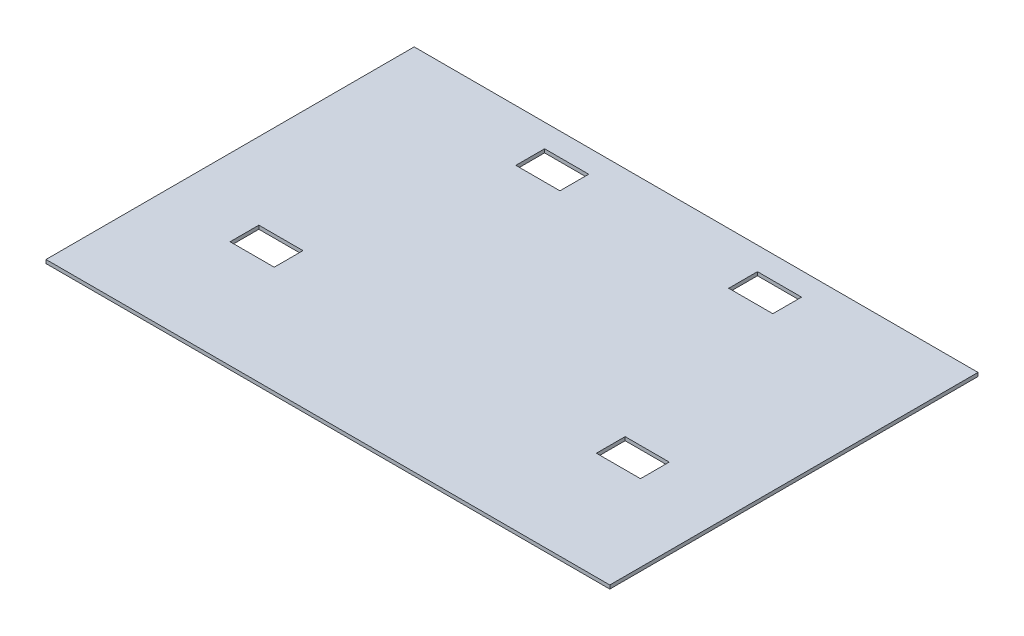
ISO-10303-21;
HEADER;
FILE_DESCRIPTION(('STEP AP214'),'2;1');
FILE_NAME('part.step','',(''),(''),'','','');
FILE_SCHEMA(('AUTOMOTIVE_DESIGN { 1 0 10303 214 1 1 1 1 }'));
ENDSEC;
DATA;
#1=APPLICATION_CONTEXT('core data for automotive mechanical design processes');
#2=APPLICATION_PROTOCOL_DEFINITION('international standard','automotive_design',2000,#1);
#3=PRODUCT_CONTEXT('',#1,'mechanical');
#4=PRODUCT('Part','Part','',(#3));
#5=PRODUCT_RELATED_PRODUCT_CATEGORY('part','',(#4));
#6=PRODUCT_DEFINITION_FORMATION('','',#4);
#7=PRODUCT_DEFINITION_CONTEXT('part definition',#1,'design');
#8=PRODUCT_DEFINITION('design','',#6,#7);
#9=PRODUCT_DEFINITION_SHAPE('','',#8);
#10=(LENGTH_UNIT() NAMED_UNIT(*) SI_UNIT(.MILLI.,.METRE.));
#11=(NAMED_UNIT(*) PLANE_ANGLE_UNIT() SI_UNIT($,.RADIAN.));
#12=(NAMED_UNIT(*) SI_UNIT($,.STERADIAN.) SOLID_ANGLE_UNIT());
#13=UNCERTAINTY_MEASURE_WITH_UNIT(LENGTH_MEASURE(1.E-05),#10,'distance_accuracy_value','');
#14=(GEOMETRIC_REPRESENTATION_CONTEXT(3) GLOBAL_UNCERTAINTY_ASSIGNED_CONTEXT((#13)) GLOBAL_UNIT_ASSIGNED_CONTEXT((#10,
#11,#12)) REPRESENTATION_CONTEXT('',''));
#15=CARTESIAN_POINT('',(0.,0.,0.));
#16=DIRECTION('',(0.,0.,1.));
#17=DIRECTION('',(1.,0.,0.));
#18=AXIS2_PLACEMENT_3D('',#15,#16,#17);
#19=CARTESIAN_POINT('',(933.45,5.953125,609.6));
#20=DIRECTION('',(-1.,0.,0.));
#21=DIRECTION('',(0.,0.,1.));
#22=AXIS2_PLACEMENT_3D('',#19,#20,#21);
#23=PLANE('',#22);
#24=DIRECTION('',(0.,0.,-1.));
#25=VECTOR('',#24,1.);
#26=CARTESIAN_POINT('',(933.45,-5.953125,609.6));
#27=LINE('',#26,#25);
#28=CARTESIAN_POINT('',(933.45,-5.953125,609.6));
#29=VERTEX_POINT('',#28);
#30=CARTESIAN_POINT('',(933.45,-5.953125,-609.6));
#31=VERTEX_POINT('',#30);
#32=EDGE_CURVE('E304',#29,#31,#27,.T.);
#33=ORIENTED_EDGE('',*,*,#32,.T.);
#34=DIRECTION('',(0.,-1.,0.));
#35=VECTOR('',#34,1.);
#36=CARTESIAN_POINT('',(933.45,5.953125,-609.6));
#37=LINE('',#36,#35);
#38=CARTESIAN_POINT('',(933.45,5.953125,-609.6));
#39=VERTEX_POINT('',#38);
#40=EDGE_CURVE('E11',#39,#31,#37,.T.);
#41=ORIENTED_EDGE('',*,*,#40,.F.);
#42=DIRECTION('',(0.,0.,-1.));
#43=VECTOR('',#42,1.);
#44=CARTESIAN_POINT('',(933.45,5.953125,609.6));
#45=LINE('',#44,#43);
#46=CARTESIAN_POINT('',(933.45,5.953125,609.6));
#47=VERTEX_POINT('',#46);
#48=EDGE_CURVE('E311',#47,#39,#45,.T.);
#49=ORIENTED_EDGE('',*,*,#48,.F.);
#50=DIRECTION('',(0.,-1.,0.));
#51=VECTOR('',#50,1.);
#52=CARTESIAN_POINT('',(933.45,5.953125,609.6));
#53=LINE('',#52,#51);
#54=EDGE_CURVE('E321',#47,#29,#53,.T.);
#55=ORIENTED_EDGE('',*,*,#54,.T.);
#56=EDGE_LOOP('',(#33,#41,#49,#55));
#57=FACE_BOUND('',#56,.T.);
#58=ADVANCED_FACE('F43',(#57),#23,.F.);
#59=CARTESIAN_POINT('',(-933.45,5.953125,-609.6));
#60=DIRECTION('',(0.,0.,1.));
#61=DIRECTION('',(1.,0.,0.));
#62=AXIS2_PLACEMENT_3D('',#59,#60,#61);
#63=PLANE('',#62);
#64=DIRECTION('',(-1.,0.,0.));
#65=VECTOR('',#64,1.);
#66=CARTESIAN_POINT('',(-933.45,-5.953125,-609.6));
#67=LINE('',#66,#65);
#68=CARTESIAN_POINT('',(-933.45,-5.953125,-609.6));
#69=VERTEX_POINT('',#68);
#70=EDGE_CURVE('E324',#31,#69,#67,.T.);
#71=ORIENTED_EDGE('',*,*,#70,.T.);
#72=DIRECTION('',(0.,-1.,0.));
#73=VECTOR('',#72,1.);
#74=CARTESIAN_POINT('',(-933.45,5.953125,-609.6));
#75=LINE('',#74,#73);
#76=CARTESIAN_POINT('',(-933.45,5.953125,-609.6));
#77=VERTEX_POINT('',#76);
#78=EDGE_CURVE('E50',#77,#69,#75,.T.);
#79=ORIENTED_EDGE('',*,*,#78,.F.);
#80=DIRECTION('',(-1.,0.,0.));
#81=VECTOR('',#80,1.);
#82=CARTESIAN_POINT('',(-933.45,5.953125,-609.6));
#83=LINE('',#82,#81);
#84=EDGE_CURVE('E314',#39,#77,#83,.T.);
#85=ORIENTED_EDGE('',*,*,#84,.F.);
#86=ORIENTED_EDGE('',*,*,#40,.T.);
#87=EDGE_LOOP('',(#71,#79,#85,#86));
#88=FACE_BOUND('',#87,.T.);
#89=ADVANCED_FACE('F353',(#88),#63,.F.);
#90=CARTESIAN_POINT('',(-933.45,5.953125,609.6));
#91=DIRECTION('',(1.,0.,0.));
#92=DIRECTION('',(0.,0.,-1.));
#93=AXIS2_PLACEMENT_3D('',#90,#91,#92);
#94=PLANE('',#93);
#95=DIRECTION('',(0.,0.,1.));
#96=VECTOR('',#95,1.);
#97=CARTESIAN_POINT('',(-933.45,-5.953125,609.6));
#98=LINE('',#97,#96);
#99=CARTESIAN_POINT('',(-933.45,-5.953125,609.6));
#100=VERTEX_POINT('',#99);
#101=EDGE_CURVE('E326',#69,#100,#98,.T.);
#102=ORIENTED_EDGE('',*,*,#101,.T.);
#103=DIRECTION('',(0.,-1.,0.));
#104=VECTOR('',#103,1.);
#105=CARTESIAN_POINT('',(-933.45,5.953125,609.6));
#106=LINE('',#105,#104);
#107=CARTESIAN_POINT('',(-933.45,5.953125,609.6));
#108=VERTEX_POINT('',#107);
#109=EDGE_CURVE('E331',#108,#100,#106,.T.);
#110=ORIENTED_EDGE('',*,*,#109,.F.);
#111=DIRECTION('',(0.,0.,1.));
#112=VECTOR('',#111,1.);
#113=CARTESIAN_POINT('',(-933.45,5.953125,609.6));
#114=LINE('',#113,#112);
#115=EDGE_CURVE('E317',#77,#108,#114,.T.);
#116=ORIENTED_EDGE('',*,*,#115,.F.);
#117=ORIENTED_EDGE('',*,*,#78,.T.);
#118=EDGE_LOOP('',(#102,#110,#116,#117));
#119=FACE_BOUND('',#118,.T.);
#120=ADVANCED_FACE('F338',(#119),#94,.F.);
#121=CARTESIAN_POINT('',(-933.45,5.953125,609.6));
#122=DIRECTION('',(0.,0.,-1.));
#123=DIRECTION('',(-1.,0.,0.));
#124=AXIS2_PLACEMENT_3D('',#121,#122,#123);
#125=PLANE('',#124);
#126=DIRECTION('',(1.,0.,0.));
#127=VECTOR('',#126,1.);
#128=CARTESIAN_POINT('',(-933.45,-5.953125,609.6));
#129=LINE('',#128,#127);
#130=EDGE_CURVE('E315',#100,#29,#129,.T.);
#131=ORIENTED_EDGE('',*,*,#130,.T.);
#132=ORIENTED_EDGE('',*,*,#54,.F.);
#133=DIRECTION('',(1.,0.,0.));
#134=VECTOR('',#133,1.);
#135=CARTESIAN_POINT('',(-933.45,5.953125,609.6));
#136=LINE('',#135,#134);
#137=EDGE_CURVE('E319',#108,#47,#136,.T.);
#138=ORIENTED_EDGE('',*,*,#137,.F.);
#139=ORIENTED_EDGE('',*,*,#109,.T.);
#140=EDGE_LOOP('',(#131,#132,#138,#139));
#141=FACE_BOUND('',#140,.T.);
#142=ADVANCED_FACE('F346',(#141),#125,.F.);
#143=CARTESIAN_POINT('',(0.,5.953125,0.));
#144=DIRECTION('',(0.,-1.,0.));
#145=DIRECTION('',(0.,0.,-1.));
#146=AXIS2_PLACEMENT_3D('',#143,#144,#145);
#147=PLANE('',#146);
#148=DIRECTION('',(-1.,0.,0.));
#149=VECTOR('',#148,1.);
#150=CARTESIAN_POINT('',(679.45,5.953125,254.));
#151=LINE('',#150,#149);
#152=CARTESIAN_POINT('',(679.45,5.953125,254.));
#153=VERTEX_POINT('',#152);
#154=CARTESIAN_POINT('',(533.4,5.953125,254.));
#155=VERTEX_POINT('',#154);
#156=EDGE_CURVE('E255',#153,#155,#151,.T.);
#157=ORIENTED_EDGE('',*,*,#156,.T.);
#158=DIRECTION('',(0.,0.,-1.));
#159=VECTOR('',#158,1.);
#160=CARTESIAN_POINT('',(533.4,5.953125,158.75));
#161=LINE('',#160,#159);
#162=CARTESIAN_POINT('',(533.4,5.953125,158.75));
#163=VERTEX_POINT('',#162);
#164=EDGE_CURVE('E266',#155,#163,#161,.T.);
#165=ORIENTED_EDGE('',*,*,#164,.T.);
#166=DIRECTION('',(1.,0.,0.));
#167=VECTOR('',#166,1.);
#168=CARTESIAN_POINT('',(679.45,5.953125,158.75));
#169=LINE('',#168,#167);
#170=CARTESIAN_POINT('',(679.45,5.953125,158.75));
#171=VERTEX_POINT('',#170);
#172=EDGE_CURVE('E276',#163,#171,#169,.T.);
#173=ORIENTED_EDGE('',*,*,#172,.T.);
#174=DIRECTION('',(0.,0.,1.));
#175=VECTOR('',#174,1.);
#176=CARTESIAN_POINT('',(679.45,5.953125,158.75));
#177=LINE('',#176,#175);
#178=EDGE_CURVE('E57',#171,#153,#177,.T.);
#179=ORIENTED_EDGE('',*,*,#178,.T.);
#180=EDGE_LOOP('',(#157,#165,#173,#179));
#181=FACE_BOUND('',#180,.T.);
#182=DIRECTION('',(-1.,0.,0.));
#183=VECTOR('',#182,1.);
#184=CARTESIAN_POINT('',(-533.4,5.953125,254.));
#185=LINE('',#184,#183);
#186=CARTESIAN_POINT('',(-533.4,5.953125,254.));
#187=VERTEX_POINT('',#186);
#188=CARTESIAN_POINT('',(-679.45,5.953125,254.));
#189=VERTEX_POINT('',#188);
#190=EDGE_CURVE('E225',#187,#189,#185,.T.);
#191=ORIENTED_EDGE('',*,*,#190,.T.);
#192=DIRECTION('',(0.,0.,-1.));
#193=VECTOR('',#192,1.);
#194=CARTESIAN_POINT('',(-679.45,5.953125,158.75));
#195=LINE('',#194,#193);
#196=CARTESIAN_POINT('',(-679.45,5.953125,158.75));
#197=VERTEX_POINT('',#196);
#198=EDGE_CURVE('E237',#189,#197,#195,.T.);
#199=ORIENTED_EDGE('',*,*,#198,.T.);
#200=DIRECTION('',(1.,0.,0.));
#201=VECTOR('',#200,1.);
#202=CARTESIAN_POINT('',(-533.4,5.953125,158.75));
#203=LINE('',#202,#201);
#204=CARTESIAN_POINT('',(-533.4,5.953125,158.75));
#205=VERTEX_POINT('',#204);
#206=EDGE_CURVE('E247',#197,#205,#203,.T.);
#207=ORIENTED_EDGE('',*,*,#206,.T.);
#208=DIRECTION('',(0.,0.,1.));
#209=VECTOR('',#208,1.);
#210=CARTESIAN_POINT('',(-533.4,5.953125,158.75));
#211=LINE('',#210,#209);
#212=EDGE_CURVE('E65',#205,#187,#211,.T.);
#213=ORIENTED_EDGE('',*,*,#212,.T.);
#214=EDGE_LOOP('',(#191,#199,#207,#213));
#215=FACE_BOUND('',#214,.T.);
#216=DIRECTION('',(-1.,0.,0.));
#217=VECTOR('',#216,1.);
#218=CARTESIAN_POINT('',(-279.4,5.953125,-438.15));
#219=LINE('',#218,#217);
#220=CARTESIAN_POINT('',(-279.4,5.953125,-438.15));
#221=VERTEX_POINT('',#220);
#222=CARTESIAN_POINT('',(-425.45,5.953125,-438.15));
#223=VERTEX_POINT('',#222);
#224=EDGE_CURVE('E212',#221,#223,#219,.T.);
#225=ORIENTED_EDGE('',*,*,#224,.T.);
#226=DIRECTION('',(0.,0.,-1.));
#227=VECTOR('',#226,1.);
#228=CARTESIAN_POINT('',(-425.45,5.953125,-533.4));
#229=LINE('',#228,#227);
#230=CARTESIAN_POINT('',(-425.45,5.953125,-533.4));
#231=VERTEX_POINT('',#230);
#232=EDGE_CURVE('E185',#223,#231,#229,.T.);
#233=ORIENTED_EDGE('',*,*,#232,.T.);
#234=DIRECTION('',(1.,0.,0.));
#235=VECTOR('',#234,1.);
#236=CARTESIAN_POINT('',(-279.4,5.953125,-533.4));
#237=LINE('',#236,#235);
#238=CARTESIAN_POINT('',(-279.4,5.953125,-533.4));
#239=VERTEX_POINT('',#238);
#240=EDGE_CURVE('E218',#231,#239,#237,.T.);
#241=ORIENTED_EDGE('',*,*,#240,.T.);
#242=DIRECTION('',(0.,0.,1.));
#243=VECTOR('',#242,1.);
#244=CARTESIAN_POINT('',(-279.4,5.953125,-533.4));
#245=LINE('',#244,#243);
#246=EDGE_CURVE('E214',#239,#221,#245,.T.);
#247=ORIENTED_EDGE('',*,*,#246,.T.);
#248=EDGE_LOOP('',(#225,#233,#241,#247));
#249=FACE_BOUND('',#248,.T.);
#250=DIRECTION('',(-1.,0.,0.));
#251=VECTOR('',#250,1.);
#252=CARTESIAN_POINT('',(425.45,5.953125,-438.15));
#253=LINE('',#252,#251);
#254=CARTESIAN_POINT('',(425.45,5.953125,-438.15));
#255=VERTEX_POINT('',#254);
#256=CARTESIAN_POINT('',(279.4,5.953125,-438.15));
#257=VERTEX_POINT('',#256);
#258=EDGE_CURVE('E291',#255,#257,#253,.T.);
#259=ORIENTED_EDGE('',*,*,#258,.T.);
#260=DIRECTION('',(0.,0.,-1.));
#261=VECTOR('',#260,1.);
#262=CARTESIAN_POINT('',(279.4,5.953125,-533.4));
#263=LINE('',#262,#261);
#264=CARTESIAN_POINT('',(279.4,5.953125,-533.4));
#265=VERTEX_POINT('',#264);
#266=EDGE_CURVE('E281',#257,#265,#263,.T.);
#267=ORIENTED_EDGE('',*,*,#266,.T.);
#268=DIRECTION('',(1.,0.,0.));
#269=VECTOR('',#268,1.);
#270=CARTESIAN_POINT('',(425.45,5.953125,-533.4));
#271=LINE('',#270,#269);
#272=CARTESIAN_POINT('',(425.45,5.953125,-533.4));
#273=VERTEX_POINT('',#272);
#274=EDGE_CURVE('E284',#265,#273,#271,.T.);
#275=ORIENTED_EDGE('',*,*,#274,.T.);
#276=DIRECTION('',(0.,0.,1.));
#277=VECTOR('',#276,1.);
#278=CARTESIAN_POINT('',(425.45,5.953125,-533.4));
#279=LINE('',#278,#277);
#280=EDGE_CURVE('E288',#273,#255,#279,.T.);
#281=ORIENTED_EDGE('',*,*,#280,.T.);
#282=EDGE_LOOP('',(#259,#267,#275,#281));
#283=FACE_BOUND('',#282,.T.);
#284=ORIENTED_EDGE('',*,*,#48,.T.);
#285=ORIENTED_EDGE('',*,*,#84,.T.);
#286=ORIENTED_EDGE('',*,*,#115,.T.);
#287=ORIENTED_EDGE('',*,*,#137,.T.);
#288=EDGE_LOOP('',(#284,#285,#286,#287));
#289=FACE_BOUND('',#288,.T.);
#290=ADVANCED_FACE('F352',(#181,#215,#249,#283,#289),#147,.F.);
#291=CARTESIAN_POINT('',(0.,-5.953125,0.));
#292=DIRECTION('',(0.,-1.,0.));
#293=DIRECTION('',(0.,0.,-1.));
#294=AXIS2_PLACEMENT_3D('',#291,#292,#293);
#295=PLANE('',#294);
#296=DIRECTION('',(0.,0.,-1.));
#297=VECTOR('',#296,1.);
#298=CARTESIAN_POINT('',(533.4,-5.953125,158.75));
#299=LINE('',#298,#297);
#300=CARTESIAN_POINT('',(533.4,-5.953125,254.));
#301=VERTEX_POINT('',#300);
#302=CARTESIAN_POINT('',(533.4,-5.953125,158.75));
#303=VERTEX_POINT('',#302);
#304=EDGE_CURVE('E232',#301,#303,#299,.T.);
#305=ORIENTED_EDGE('',*,*,#304,.F.);
#306=DIRECTION('',(-1.,0.,0.));
#307=VECTOR('',#306,1.);
#308=CARTESIAN_POINT('',(679.45,-5.953125,254.));
#309=LINE('',#308,#307);
#310=CARTESIAN_POINT('',(679.45,-5.953125,254.));
#311=VERTEX_POINT('',#310);
#312=EDGE_CURVE('E262',#311,#301,#309,.T.);
#313=ORIENTED_EDGE('',*,*,#312,.F.);
#314=DIRECTION('',(0.,0.,1.));
#315=VECTOR('',#314,1.);
#316=CARTESIAN_POINT('',(679.45,-5.953125,158.75));
#317=LINE('',#316,#315);
#318=CARTESIAN_POINT('',(679.45,-5.953125,158.75));
#319=VERTEX_POINT('',#318);
#320=EDGE_CURVE('E265',#319,#311,#317,.T.);
#321=ORIENTED_EDGE('',*,*,#320,.F.);
#322=DIRECTION('',(1.,0.,0.));
#323=VECTOR('',#322,1.);
#324=CARTESIAN_POINT('',(679.45,-5.953125,158.75));
#325=LINE('',#324,#323);
#326=EDGE_CURVE('E269',#303,#319,#325,.T.);
#327=ORIENTED_EDGE('',*,*,#326,.F.);
#328=EDGE_LOOP('',(#305,#313,#321,#327));
#329=FACE_BOUND('',#328,.T.);
#330=DIRECTION('',(0.,0.,-1.));
#331=VECTOR('',#330,1.);
#332=CARTESIAN_POINT('',(-679.45,-5.953125,158.75));
#333=LINE('',#332,#331);
#334=CARTESIAN_POINT('',(-679.45,-5.953125,254.));
#335=VERTEX_POINT('',#334);
#336=CARTESIAN_POINT('',(-679.45,-5.953125,158.75));
#337=VERTEX_POINT('',#336);
#338=EDGE_CURVE('E190',#335,#337,#333,.T.);
#339=ORIENTED_EDGE('',*,*,#338,.F.);
#340=DIRECTION('',(-1.,0.,0.));
#341=VECTOR('',#340,1.);
#342=CARTESIAN_POINT('',(-533.4,-5.953125,254.));
#343=LINE('',#342,#341);
#344=CARTESIAN_POINT('',(-533.4,-5.953125,254.));
#345=VERTEX_POINT('',#344);
#346=EDGE_CURVE('E233',#345,#335,#343,.T.);
#347=ORIENTED_EDGE('',*,*,#346,.F.);
#348=DIRECTION('',(0.,0.,1.));
#349=VECTOR('',#348,1.);
#350=CARTESIAN_POINT('',(-533.4,-5.953125,158.75));
#351=LINE('',#350,#349);
#352=CARTESIAN_POINT('',(-533.4,-5.953125,158.75));
#353=VERTEX_POINT('',#352);
#354=EDGE_CURVE('E236',#353,#345,#351,.T.);
#355=ORIENTED_EDGE('',*,*,#354,.F.);
#356=DIRECTION('',(1.,0.,0.));
#357=VECTOR('',#356,1.);
#358=CARTESIAN_POINT('',(-533.4,-5.953125,158.75));
#359=LINE('',#358,#357);
#360=EDGE_CURVE('E240',#337,#353,#359,.T.);
#361=ORIENTED_EDGE('',*,*,#360,.F.);
#362=EDGE_LOOP('',(#339,#347,#355,#361));
#363=FACE_BOUND('',#362,.T.);
#364=DIRECTION('',(0.,0.,-1.));
#365=VECTOR('',#364,1.);
#366=CARTESIAN_POINT('',(-425.45,-5.953125,-533.4));
#367=LINE('',#366,#365);
#368=CARTESIAN_POINT('',(-425.45,-5.953125,-438.15));
#369=VERTEX_POINT('',#368);
#370=CARTESIAN_POINT('',(-425.45,-5.953125,-533.4));
#371=VERTEX_POINT('',#370);
#372=EDGE_CURVE('E182',#369,#371,#367,.T.);
#373=ORIENTED_EDGE('',*,*,#372,.F.);
#374=DIRECTION('',(-1.,0.,0.));
#375=VECTOR('',#374,1.);
#376=CARTESIAN_POINT('',(-279.4,-5.953125,-438.15));
#377=LINE('',#376,#375);
#378=CARTESIAN_POINT('',(-279.4,-5.953125,-438.15));
#379=VERTEX_POINT('',#378);
#380=EDGE_CURVE('E193',#379,#369,#377,.T.);
#381=ORIENTED_EDGE('',*,*,#380,.F.);
#382=DIRECTION('',(0.,0.,1.));
#383=VECTOR('',#382,1.);
#384=CARTESIAN_POINT('',(-279.4,-5.953125,-533.4));
#385=LINE('',#384,#383);
#386=CARTESIAN_POINT('',(-279.4,-5.953125,-533.4));
#387=VERTEX_POINT('',#386);
#388=EDGE_CURVE('E198',#387,#379,#385,.T.);
#389=ORIENTED_EDGE('',*,*,#388,.F.);
#390=DIRECTION('',(1.,0.,0.));
#391=VECTOR('',#390,1.);
#392=CARTESIAN_POINT('',(-279.4,-5.953125,-533.4));
#393=LINE('',#392,#391);
#394=EDGE_CURVE('E204',#371,#387,#393,.T.);
#395=ORIENTED_EDGE('',*,*,#394,.F.);
#396=EDGE_LOOP('',(#373,#381,#389,#395));
#397=FACE_BOUND('',#396,.T.);
#398=DIRECTION('',(0.,0.,-1.));
#399=VECTOR('',#398,1.);
#400=CARTESIAN_POINT('',(279.4,-5.953125,-533.4));
#401=LINE('',#400,#399);
#402=CARTESIAN_POINT('',(279.4,-5.953125,-438.15));
#403=VERTEX_POINT('',#402);
#404=CARTESIAN_POINT('',(279.4,-5.953125,-533.4));
#405=VERTEX_POINT('',#404);
#406=EDGE_CURVE('E205',#403,#405,#401,.T.);
#407=ORIENTED_EDGE('',*,*,#406,.F.);
#408=DIRECTION('',(-1.,0.,0.));
#409=VECTOR('',#408,1.);
#410=CARTESIAN_POINT('',(425.45,-5.953125,-438.15));
#411=LINE('',#410,#409);
#412=CARTESIAN_POINT('',(425.45,-5.953125,-438.15));
#413=VERTEX_POINT('',#412);
#414=EDGE_CURVE('E285',#413,#403,#411,.T.);
#415=ORIENTED_EDGE('',*,*,#414,.F.);
#416=DIRECTION('',(0.,0.,1.));
#417=VECTOR('',#416,1.);
#418=CARTESIAN_POINT('',(425.45,-5.953125,-533.4));
#419=LINE('',#418,#417);
#420=CARTESIAN_POINT('',(425.45,-5.953125,-533.4));
#421=VERTEX_POINT('',#420);
#422=EDGE_CURVE('E297',#421,#413,#419,.T.);
#423=ORIENTED_EDGE('',*,*,#422,.F.);
#424=DIRECTION('',(1.,0.,0.));
#425=VECTOR('',#424,1.);
#426=CARTESIAN_POINT('',(425.45,-5.953125,-533.4));
#427=LINE('',#426,#425);
#428=EDGE_CURVE('E207',#405,#421,#427,.T.);
#429=ORIENTED_EDGE('',*,*,#428,.F.);
#430=EDGE_LOOP('',(#407,#415,#423,#429));
#431=FACE_BOUND('',#430,.T.);
#432=ORIENTED_EDGE('',*,*,#32,.F.);
#433=ORIENTED_EDGE('',*,*,#130,.F.);
#434=ORIENTED_EDGE('',*,*,#101,.F.);
#435=ORIENTED_EDGE('',*,*,#70,.F.);
#436=EDGE_LOOP('',(#432,#433,#434,#435));
#437=FACE_BOUND('',#436,.T.);
#438=ADVANCED_FACE('F201',(#329,#363,#397,#431,#437),#295,.T.);
#439=CARTESIAN_POINT('',(279.4,5.953125,-533.4));
#440=DIRECTION('',(-1.,0.,0.));
#441=DIRECTION('',(0.,0.,1.));
#442=AXIS2_PLACEMENT_3D('',#439,#440,#441);
#443=PLANE('',#442);
#444=ORIENTED_EDGE('',*,*,#406,.T.);
#445=DIRECTION('',(0.,-1.,0.));
#446=VECTOR('',#445,1.);
#447=CARTESIAN_POINT('',(279.4,5.953125,-533.4));
#448=LINE('',#447,#446);
#449=EDGE_CURVE('E293',#265,#405,#448,.T.);
#450=ORIENTED_EDGE('',*,*,#449,.F.);
#451=ORIENTED_EDGE('',*,*,#266,.F.);
#452=DIRECTION('',(0.,-1.,0.));
#453=VECTOR('',#452,1.);
#454=CARTESIAN_POINT('',(279.4,5.953125,-438.15));
#455=LINE('',#454,#453);
#456=EDGE_CURVE('E302',#257,#403,#455,.T.);
#457=ORIENTED_EDGE('',*,*,#456,.T.);
#458=EDGE_LOOP('',(#444,#450,#451,#457));
#459=FACE_BOUND('',#458,.T.);
#460=ADVANCED_FACE('F365',(#459),#443,.F.);
#461=CARTESIAN_POINT('',(425.45,5.953125,-438.15));
#462=DIRECTION('',(0.,0.,1.));
#463=DIRECTION('',(1.,0.,0.));
#464=AXIS2_PLACEMENT_3D('',#461,#462,#463);
#465=PLANE('',#464);
#466=ORIENTED_EDGE('',*,*,#414,.T.);
#467=ORIENTED_EDGE('',*,*,#456,.F.);
#468=ORIENTED_EDGE('',*,*,#258,.F.);
#469=DIRECTION('',(0.,-1.,0.));
#470=VECTOR('',#469,1.);
#471=CARTESIAN_POINT('',(425.45,5.953125,-438.15));
#472=LINE('',#471,#470);
#473=EDGE_CURVE('E305',#255,#413,#472,.T.);
#474=ORIENTED_EDGE('',*,*,#473,.T.);
#475=EDGE_LOOP('',(#466,#467,#468,#474));
#476=FACE_BOUND('',#475,.T.);
#477=ADVANCED_FACE('F372',(#476),#465,.F.);
#478=CARTESIAN_POINT('',(425.45,5.953125,-533.4));
#479=DIRECTION('',(1.,0.,0.));
#480=DIRECTION('',(0.,0.,-1.));
#481=AXIS2_PLACEMENT_3D('',#478,#479,#480);
#482=PLANE('',#481);
#483=ORIENTED_EDGE('',*,*,#422,.T.);
#484=ORIENTED_EDGE('',*,*,#473,.F.);
#485=ORIENTED_EDGE('',*,*,#280,.F.);
#486=DIRECTION('',(0.,-1.,0.));
#487=VECTOR('',#486,1.);
#488=CARTESIAN_POINT('',(425.45,5.953125,-533.4));
#489=LINE('',#488,#487);
#490=EDGE_CURVE('E307',#273,#421,#489,.T.);
#491=ORIENTED_EDGE('',*,*,#490,.T.);
#492=EDGE_LOOP('',(#483,#484,#485,#491));
#493=FACE_BOUND('',#492,.T.);
#494=ADVANCED_FACE('F377',(#493),#482,.F.);
#495=CARTESIAN_POINT('',(425.45,5.953125,-533.4));
#496=DIRECTION('',(0.,0.,-1.));
#497=DIRECTION('',(-1.,0.,0.));
#498=AXIS2_PLACEMENT_3D('',#495,#496,#497);
#499=PLANE('',#498);
#500=ORIENTED_EDGE('',*,*,#428,.T.);
#501=ORIENTED_EDGE('',*,*,#490,.F.);
#502=ORIENTED_EDGE('',*,*,#274,.F.);
#503=ORIENTED_EDGE('',*,*,#449,.T.);
#504=EDGE_LOOP('',(#500,#501,#502,#503));
#505=FACE_BOUND('',#504,.T.);
#506=ADVANCED_FACE('F374',(#505),#499,.F.);
#507=CARTESIAN_POINT('',(-425.45,5.953125,-533.4));
#508=DIRECTION('',(-1.,0.,0.));
#509=DIRECTION('',(0.,0.,1.));
#510=AXIS2_PLACEMENT_3D('',#507,#508,#509);
#511=PLANE('',#510);
#512=ORIENTED_EDGE('',*,*,#372,.T.);
#513=DIRECTION('',(0.,-1.,0.));
#514=VECTOR('',#513,1.);
#515=CARTESIAN_POINT('',(-425.45,5.953125,-533.4));
#516=LINE('',#515,#514);
#517=EDGE_CURVE('E215',#231,#371,#516,.T.);
#518=ORIENTED_EDGE('',*,*,#517,.F.);
#519=ORIENTED_EDGE('',*,*,#232,.F.);
#520=DIRECTION('',(0.,-1.,0.));
#521=VECTOR('',#520,1.);
#522=CARTESIAN_POINT('',(-425.45,5.953125,-438.15));
#523=LINE('',#522,#521);
#524=EDGE_CURVE('E178',#223,#369,#523,.T.);
#525=ORIENTED_EDGE('',*,*,#524,.T.);
#526=EDGE_LOOP('',(#512,#518,#519,#525));
#527=FACE_BOUND('',#526,.T.);
#528=ADVANCED_FACE('F180',(#527),#511,.F.);
#529=CARTESIAN_POINT('',(-279.4,5.953125,-438.15));
#530=DIRECTION('',(0.,0.,1.));
#531=DIRECTION('',(1.,0.,0.));
#532=AXIS2_PLACEMENT_3D('',#529,#530,#531);
#533=PLANE('',#532);
#534=ORIENTED_EDGE('',*,*,#380,.T.);
#535=ORIENTED_EDGE('',*,*,#524,.F.);
#536=ORIENTED_EDGE('',*,*,#224,.F.);
#537=DIRECTION('',(0.,-1.,0.));
#538=VECTOR('',#537,1.);
#539=CARTESIAN_POINT('',(-279.4,5.953125,-438.15));
#540=LINE('',#539,#538);
#541=EDGE_CURVE('E189',#221,#379,#540,.T.);
#542=ORIENTED_EDGE('',*,*,#541,.T.);
#543=EDGE_LOOP('',(#534,#535,#536,#542));
#544=FACE_BOUND('',#543,.T.);
#545=ADVANCED_FACE('F194',(#544),#533,.F.);
#546=CARTESIAN_POINT('',(-279.4,5.953125,-533.4));
#547=DIRECTION('',(1.,0.,0.));
#548=DIRECTION('',(0.,0.,-1.));
#549=AXIS2_PLACEMENT_3D('',#546,#547,#548);
#550=PLANE('',#549);
#551=ORIENTED_EDGE('',*,*,#388,.T.);
#552=ORIENTED_EDGE('',*,*,#541,.F.);
#553=ORIENTED_EDGE('',*,*,#246,.F.);
#554=DIRECTION('',(0.,-1.,0.));
#555=VECTOR('',#554,1.);
#556=CARTESIAN_POINT('',(-279.4,5.953125,-533.4));
#557=LINE('',#556,#555);
#558=EDGE_CURVE('E558',#239,#387,#557,.T.);
#559=ORIENTED_EDGE('',*,*,#558,.T.);
#560=EDGE_LOOP('',(#551,#552,#553,#559));
#561=FACE_BOUND('',#560,.T.);
#562=ADVANCED_FACE('F418',(#561),#550,.F.);
#563=CARTESIAN_POINT('',(-279.4,5.953125,-533.4));
#564=DIRECTION('',(0.,0.,-1.));
#565=DIRECTION('',(-1.,0.,0.));
#566=AXIS2_PLACEMENT_3D('',#563,#564,#565);
#567=PLANE('',#566);
#568=ORIENTED_EDGE('',*,*,#394,.T.);
#569=ORIENTED_EDGE('',*,*,#558,.F.);
#570=ORIENTED_EDGE('',*,*,#240,.F.);
#571=ORIENTED_EDGE('',*,*,#517,.T.);
#572=EDGE_LOOP('',(#568,#569,#570,#571));
#573=FACE_BOUND('',#572,.T.);
#574=ADVANCED_FACE('F414',(#573),#567,.F.);
#575=CARTESIAN_POINT('',(-679.45,5.953125,158.75));
#576=DIRECTION('',(-1.,0.,0.));
#577=DIRECTION('',(0.,0.,1.));
#578=AXIS2_PLACEMENT_3D('',#575,#576,#577);
#579=PLANE('',#578);
#580=ORIENTED_EDGE('',*,*,#338,.T.);
#581=DIRECTION('',(0.,-1.,0.));
#582=VECTOR('',#581,1.);
#583=CARTESIAN_POINT('',(-679.45,5.953125,158.75));
#584=LINE('',#583,#582);
#585=EDGE_CURVE('E222',#197,#337,#584,.T.);
#586=ORIENTED_EDGE('',*,*,#585,.F.);
#587=ORIENTED_EDGE('',*,*,#198,.F.);
#588=DIRECTION('',(0.,-1.,0.));
#589=VECTOR('',#588,1.);
#590=CARTESIAN_POINT('',(-679.45,5.953125,254.));
#591=LINE('',#590,#589);
#592=EDGE_CURVE('E230',#189,#335,#591,.T.);
#593=ORIENTED_EDGE('',*,*,#592,.T.);
#594=EDGE_LOOP('',(#580,#586,#587,#593));
#595=FACE_BOUND('',#594,.T.);
#596=ADVANCED_FACE('F405',(#595),#579,.F.);
#597=CARTESIAN_POINT('',(-533.4,5.953125,254.));
#598=DIRECTION('',(0.,0.,1.));
#599=DIRECTION('',(1.,0.,0.));
#600=AXIS2_PLACEMENT_3D('',#597,#598,#599);
#601=PLANE('',#600);
#602=ORIENTED_EDGE('',*,*,#346,.T.);
#603=ORIENTED_EDGE('',*,*,#592,.F.);
#604=ORIENTED_EDGE('',*,*,#190,.F.);
#605=DIRECTION('',(0.,-1.,0.));
#606=VECTOR('',#605,1.);
#607=CARTESIAN_POINT('',(-533.4,5.953125,254.));
#608=LINE('',#607,#606);
#609=EDGE_CURVE('E228',#187,#345,#608,.T.);
#610=ORIENTED_EDGE('',*,*,#609,.T.);
#611=EDGE_LOOP('',(#602,#603,#604,#610));
#612=FACE_BOUND('',#611,.T.);
#613=ADVANCED_FACE('F401',(#612),#601,.F.);
#614=CARTESIAN_POINT('',(-533.4,5.953125,158.75));
#615=DIRECTION('',(1.,0.,0.));
#616=DIRECTION('',(0.,0.,-1.));
#617=AXIS2_PLACEMENT_3D('',#614,#615,#616);
#618=PLANE('',#617);
#619=ORIENTED_EDGE('',*,*,#354,.T.);
#620=ORIENTED_EDGE('',*,*,#609,.F.);
#621=ORIENTED_EDGE('',*,*,#212,.F.);
#622=DIRECTION('',(0.,-1.,0.));
#623=VECTOR('',#622,1.);
#624=CARTESIAN_POINT('',(-533.4,5.953125,158.75));
#625=LINE('',#624,#623);
#626=EDGE_CURVE('E226',#205,#353,#625,.T.);
#627=ORIENTED_EDGE('',*,*,#626,.T.);
#628=EDGE_LOOP('',(#619,#620,#621,#627));
#629=FACE_BOUND('',#628,.T.);
#630=ADVANCED_FACE('F404',(#629),#618,.F.);
#631=CARTESIAN_POINT('',(-533.4,5.953125,158.75));
#632=DIRECTION('',(0.,0.,-1.));
#633=DIRECTION('',(-1.,0.,0.));
#634=AXIS2_PLACEMENT_3D('',#631,#632,#633);
#635=PLANE('',#634);
#636=ORIENTED_EDGE('',*,*,#360,.T.);
#637=ORIENTED_EDGE('',*,*,#626,.F.);
#638=ORIENTED_EDGE('',*,*,#206,.F.);
#639=ORIENTED_EDGE('',*,*,#585,.T.);
#640=EDGE_LOOP('',(#636,#637,#638,#639));
#641=FACE_BOUND('',#640,.T.);
#642=ADVANCED_FACE('F399',(#641),#635,.F.);
#643=CARTESIAN_POINT('',(533.4,5.953125,158.75));
#644=DIRECTION('',(-1.,0.,0.));
#645=DIRECTION('',(0.,0.,1.));
#646=AXIS2_PLACEMENT_3D('',#643,#644,#645);
#647=PLANE('',#646);
#648=ORIENTED_EDGE('',*,*,#304,.T.);
#649=DIRECTION('',(0.,-1.,0.));
#650=VECTOR('',#649,1.);
#651=CARTESIAN_POINT('',(533.4,5.953125,158.75));
#652=LINE('',#651,#650);
#653=EDGE_CURVE('E252',#163,#303,#652,.T.);
#654=ORIENTED_EDGE('',*,*,#653,.F.);
#655=ORIENTED_EDGE('',*,*,#164,.F.);
#656=DIRECTION('',(0.,-1.,0.));
#657=VECTOR('',#656,1.);
#658=CARTESIAN_POINT('',(533.4,5.953125,254.));
#659=LINE('',#658,#657);
#660=EDGE_CURVE('E260',#155,#301,#659,.T.);
#661=ORIENTED_EDGE('',*,*,#660,.T.);
#662=EDGE_LOOP('',(#648,#654,#655,#661));
#663=FACE_BOUND('',#662,.T.);
#664=ADVANCED_FACE('F389',(#663),#647,.F.);
#665=CARTESIAN_POINT('',(679.45,5.953125,254.));
#666=DIRECTION('',(0.,0.,1.));
#667=DIRECTION('',(1.,0.,0.));
#668=AXIS2_PLACEMENT_3D('',#665,#666,#667);
#669=PLANE('',#668);
#670=ORIENTED_EDGE('',*,*,#312,.T.);
#671=ORIENTED_EDGE('',*,*,#660,.F.);
#672=ORIENTED_EDGE('',*,*,#156,.F.);
#673=DIRECTION('',(0.,-1.,0.));
#674=VECTOR('',#673,1.);
#675=CARTESIAN_POINT('',(679.45,5.953125,254.));
#676=LINE('',#675,#674);
#677=EDGE_CURVE('E258',#153,#311,#676,.T.);
#678=ORIENTED_EDGE('',*,*,#677,.T.);
#679=EDGE_LOOP('',(#670,#671,#672,#678));
#680=FACE_BOUND('',#679,.T.);
#681=ADVANCED_FACE('F385',(#680),#669,.F.);
#682=CARTESIAN_POINT('',(679.45,5.953125,158.75));
#683=DIRECTION('',(1.,0.,0.));
#684=DIRECTION('',(0.,0.,-1.));
#685=AXIS2_PLACEMENT_3D('',#682,#683,#684);
#686=PLANE('',#685);
#687=ORIENTED_EDGE('',*,*,#320,.T.);
#688=ORIENTED_EDGE('',*,*,#677,.F.);
#689=ORIENTED_EDGE('',*,*,#178,.F.);
#690=DIRECTION('',(0.,-1.,0.));
#691=VECTOR('',#690,1.);
#692=CARTESIAN_POINT('',(679.45,5.953125,158.75));
#693=LINE('',#692,#691);
#694=EDGE_CURVE('E256',#171,#319,#693,.T.);
#695=ORIENTED_EDGE('',*,*,#694,.T.);
#696=EDGE_LOOP('',(#687,#688,#689,#695));
#697=FACE_BOUND('',#696,.T.);
#698=ADVANCED_FACE('F388',(#697),#686,.F.);
#699=CARTESIAN_POINT('',(679.45,5.953125,158.75));
#700=DIRECTION('',(0.,0.,-1.));
#701=DIRECTION('',(-1.,0.,0.));
#702=AXIS2_PLACEMENT_3D('',#699,#700,#701);
#703=PLANE('',#702);
#704=ORIENTED_EDGE('',*,*,#326,.T.);
#705=ORIENTED_EDGE('',*,*,#694,.F.);
#706=ORIENTED_EDGE('',*,*,#172,.F.);
#707=ORIENTED_EDGE('',*,*,#653,.T.);
#708=EDGE_LOOP('',(#704,#705,#706,#707));
#709=FACE_BOUND('',#708,.T.);
#710=ADVANCED_FACE('F393',(#709),#703,.F.);
#711=CLOSED_SHELL('',(#58,#89,#120,#142,#290,#438,#460,#477,#494,#506,#528,#545,#562,#574,#596,
#613,#630,#642,#664,#681,#698,#710));
#712=MANIFOLD_SOLID_BREP('B2',#711);
#713=ADVANCED_BREP_SHAPE_REPRESENTATION('',(#18,#712),#14);
#714=SHAPE_DEFINITION_REPRESENTATION(#9,#713);
ENDSEC;
END-ISO-10303-21;
